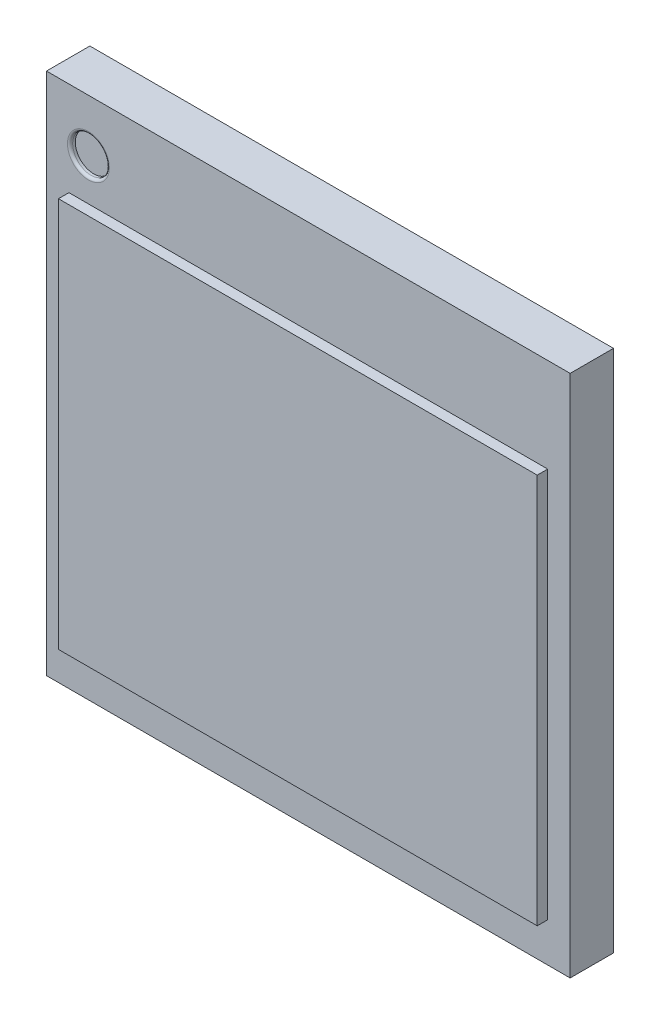
ISO-10303-21;
HEADER;
FILE_DESCRIPTION(('STEP AP214'),'2;1');
FILE_NAME('part.step','',(''),(''),'','','');
FILE_SCHEMA(('AUTOMOTIVE_DESIGN { 1 0 10303 214 1 1 1 1 }'));
ENDSEC;
DATA;
#1=APPLICATION_CONTEXT('core data for automotive mechanical design processes');
#2=APPLICATION_PROTOCOL_DEFINITION('international standard','automotive_design',2000,#1);
#3=PRODUCT_CONTEXT('',#1,'mechanical');
#4=PRODUCT('Part','Part','',(#3));
#5=PRODUCT_RELATED_PRODUCT_CATEGORY('part','',(#4));
#6=PRODUCT_DEFINITION_FORMATION('','',#4);
#7=PRODUCT_DEFINITION_CONTEXT('part definition',#1,'design');
#8=PRODUCT_DEFINITION('design','',#6,#7);
#9=PRODUCT_DEFINITION_SHAPE('','',#8);
#10=(LENGTH_UNIT() NAMED_UNIT(*) SI_UNIT(.MILLI.,.METRE.));
#11=(NAMED_UNIT(*) PLANE_ANGLE_UNIT() SI_UNIT($,.RADIAN.));
#12=(NAMED_UNIT(*) SI_UNIT($,.STERADIAN.) SOLID_ANGLE_UNIT());
#13=UNCERTAINTY_MEASURE_WITH_UNIT(LENGTH_MEASURE(1.E-05),#10,'distance_accuracy_value','');
#14=(GEOMETRIC_REPRESENTATION_CONTEXT(3) GLOBAL_UNCERTAINTY_ASSIGNED_CONTEXT((#13)) GLOBAL_UNIT_ASSIGNED_CONTEXT((#10,
#11,#12)) REPRESENTATION_CONTEXT('',''));
#15=CARTESIAN_POINT('',(0.,0.,0.));
#16=DIRECTION('',(0.,0.,1.));
#17=DIRECTION('',(1.,0.,0.));
#18=AXIS2_PLACEMENT_3D('',#15,#16,#17);
#19=CARTESIAN_POINT('',(0.,0.,0.624));
#20=DIRECTION('',(0.,0.,1.));
#21=DIRECTION('',(1.,0.,0.));
#22=AXIS2_PLACEMENT_3D('',#19,#20,#21);
#23=PLANE('',#22);
#24=CARTESIAN_POINT('',(-2.1,2.,0.624));
#25=DIRECTION('',(0.,0.,1.));
#26=DIRECTION('',(1.,0.,0.));
#27=AXIS2_PLACEMENT_3D('',#24,#25,#26);
#28=CIRCLE('',#27,0.2);
#29=CARTESIAN_POINT('',(-1.9,2.,0.624));
#30=VERTEX_POINT('',#29);
#31=EDGE_CURVE('E11',#30,#30,#28,.F.);
#32=ORIENTED_EDGE('',*,*,#31,.T.);
#33=EDGE_LOOP('',(#32));
#34=FACE_BOUND('',#33,.T.);
#35=DIRECTION('',(0.,-1.,0.));
#36=VECTOR('',#35,1.);
#37=CARTESIAN_POINT('',(-2.5,2.5,0.624));
#38=LINE('',#37,#36);
#39=CARTESIAN_POINT('',(-2.5,2.5,0.624));
#40=VERTEX_POINT('',#39);
#41=CARTESIAN_POINT('',(-2.5,-2.5,0.624));
#42=VERTEX_POINT('',#41);
#43=EDGE_CURVE('E146',#40,#42,#38,.T.);
#44=ORIENTED_EDGE('',*,*,#43,.T.);
#45=DIRECTION('',(1.,0.,0.));
#46=VECTOR('',#45,1.);
#47=CARTESIAN_POINT('',(-2.5,-2.5,0.624));
#48=LINE('',#47,#46);
#49=CARTESIAN_POINT('',(2.5,-2.5,0.624));
#50=VERTEX_POINT('',#49);
#51=EDGE_CURVE('E91',#42,#50,#48,.T.);
#52=ORIENTED_EDGE('',*,*,#51,.T.);
#53=DIRECTION('',(0.,1.,0.));
#54=VECTOR('',#53,1.);
#55=CARTESIAN_POINT('',(2.5,2.5,0.624));
#56=LINE('',#55,#54);
#57=CARTESIAN_POINT('',(2.5,2.5,0.624));
#58=VERTEX_POINT('',#57);
#59=EDGE_CURVE('E149',#50,#58,#56,.T.);
#60=ORIENTED_EDGE('',*,*,#59,.T.);
#61=DIRECTION('',(-1.,0.,0.));
#62=VECTOR('',#61,1.);
#63=CARTESIAN_POINT('',(-2.5,2.5,0.624));
#64=LINE('',#63,#62);
#65=EDGE_CURVE('E62',#58,#40,#64,.T.);
#66=ORIENTED_EDGE('',*,*,#65,.T.);
#67=EDGE_LOOP('',(#44,#52,#60,#66));
#68=FACE_BOUND('',#67,.T.);
#69=DIRECTION('',(-1.,0.,0.));
#70=VECTOR('',#69,1.);
#71=CARTESIAN_POINT('',(-2.28579882244162,1.60135243721626,0.624));
#72=LINE('',#71,#70);
#73=CARTESIAN_POINT('',(2.28579882244162,1.60135243721626,0.624));
#74=VERTEX_POINT('',#73);
#75=CARTESIAN_POINT('',(-2.28579882244162,1.60135243721626,0.624));
#76=VERTEX_POINT('',#75);
#77=EDGE_CURVE('E304',#74,#76,#72,.T.);
#78=ORIENTED_EDGE('',*,*,#77,.F.);
#79=DIRECTION('',(0.,1.,0.));
#80=VECTOR('',#79,1.);
#81=CARTESIAN_POINT('',(2.28579882244162,1.60135243721626,0.624));
#82=LINE('',#81,#80);
#83=CARTESIAN_POINT('',(2.28579882244162,-2.125692027521,0.624));
#84=VERTEX_POINT('',#83);
#85=EDGE_CURVE('E136',#84,#74,#82,.T.);
#86=ORIENTED_EDGE('',*,*,#85,.F.);
#87=DIRECTION('',(1.,0.,0.));
#88=VECTOR('',#87,1.);
#89=CARTESIAN_POINT('',(-2.28579882244162,-2.125692027521,0.624));
#90=LINE('',#89,#88);
#91=CARTESIAN_POINT('',(-2.28579882244162,-2.125692027521,0.624));
#92=VERTEX_POINT('',#91);
#93=EDGE_CURVE('E132',#92,#84,#90,.T.);
#94=ORIENTED_EDGE('',*,*,#93,.F.);
#95=DIRECTION('',(0.,-1.,0.));
#96=VECTOR('',#95,1.);
#97=CARTESIAN_POINT('',(-2.28579882244162,1.60135243721626,0.624));
#98=LINE('',#97,#96);
#99=EDGE_CURVE('E306',#76,#92,#98,.T.);
#100=ORIENTED_EDGE('',*,*,#99,.F.);
#101=EDGE_LOOP('',(#78,#86,#94,#100));
#102=FACE_BOUND('',#101,.T.);
#103=ADVANCED_FACE('F38',(#34,#68,#102),#23,.T.);
#104=CARTESIAN_POINT('',(0.,0.,0.21));
#105=DIRECTION('',(0.,0.,1.));
#106=DIRECTION('',(1.,0.,0.));
#107=AXIS2_PLACEMENT_3D('',#104,#105,#106);
#108=PLANE('',#107);
#109=DIRECTION('',(0.,-1.,0.));
#110=VECTOR('',#109,1.);
#111=CARTESIAN_POINT('',(-2.5,2.5,0.21));
#112=LINE('',#111,#110);
#113=CARTESIAN_POINT('',(-2.5,2.5,0.21));
#114=VERTEX_POINT('',#113);
#115=CARTESIAN_POINT('',(-2.5,-2.5,0.21));
#116=VERTEX_POINT('',#115);
#117=EDGE_CURVE('E141',#114,#116,#112,.T.);
#118=ORIENTED_EDGE('',*,*,#117,.F.);
#119=DIRECTION('',(-1.,0.,0.));
#120=VECTOR('',#119,1.);
#121=CARTESIAN_POINT('',(-2.5,2.5,0.21));
#122=LINE('',#121,#120);
#123=CARTESIAN_POINT('',(2.5,2.5,0.21));
#124=VERTEX_POINT('',#123);
#125=EDGE_CURVE('E83',#124,#114,#122,.T.);
#126=ORIENTED_EDGE('',*,*,#125,.F.);
#127=DIRECTION('',(0.,1.,0.));
#128=VECTOR('',#127,1.);
#129=CARTESIAN_POINT('',(2.5,2.5,0.21));
#130=LINE('',#129,#128);
#131=CARTESIAN_POINT('',(2.5,-2.5,0.21));
#132=VERTEX_POINT('',#131);
#133=EDGE_CURVE('E157',#132,#124,#130,.T.);
#134=ORIENTED_EDGE('',*,*,#133,.F.);
#135=DIRECTION('',(1.,0.,0.));
#136=VECTOR('',#135,1.);
#137=CARTESIAN_POINT('',(-2.5,-2.5,0.21));
#138=LINE('',#137,#136);
#139=EDGE_CURVE('E155',#116,#132,#138,.T.);
#140=ORIENTED_EDGE('',*,*,#139,.F.);
#141=EDGE_LOOP('',(#118,#126,#134,#140));
#142=FACE_BOUND('',#141,.T.);
#143=CARTESIAN_POINT('',(-1.96,1.9,0.21));
#144=DIRECTION('',(0.,0.,1.));
#145=DIRECTION('',(1.,0.,0.));
#146=AXIS2_PLACEMENT_3D('',#143,#144,#145);
#147=CIRCLE('',#146,0.148492424049175);
#148=CARTESIAN_POINT('',(-1.81150757595082,1.9,0.21));
#149=VERTEX_POINT('',#148);
#150=EDGE_CURVE('E168',#149,#149,#147,.F.);
#151=ORIENTED_EDGE('',*,*,#150,.F.);
#152=EDGE_LOOP('',(#151));
#153=FACE_BOUND('',#152,.T.);
#154=CARTESIAN_POINT('',(-1.16,1.9,0.21));
#155=DIRECTION('',(0.,0.,1.));
#156=DIRECTION('',(1.,0.,0.));
#157=AXIS2_PLACEMENT_3D('',#154,#155,#156);
#158=CIRCLE('',#157,0.148492424049175);
#159=CARTESIAN_POINT('',(-1.01150757595082,1.9,0.21));
#160=VERTEX_POINT('',#159);
#161=EDGE_CURVE('E171',#160,#160,#158,.F.);
#162=ORIENTED_EDGE('',*,*,#161,.F.);
#163=EDGE_LOOP('',(#162));
#164=FACE_BOUND('',#163,.T.);
#165=CARTESIAN_POINT('',(-0.36,1.9,0.21));
#166=DIRECTION('',(0.,0.,1.));
#167=DIRECTION('',(1.,0.,0.));
#168=AXIS2_PLACEMENT_3D('',#165,#166,#167);
#169=CIRCLE('',#168,0.148492424049175);
#170=CARTESIAN_POINT('',(-0.211507575950825,1.9,0.21));
#171=VERTEX_POINT('',#170);
#172=EDGE_CURVE('E174',#171,#171,#169,.F.);
#173=ORIENTED_EDGE('',*,*,#172,.F.);
#174=EDGE_LOOP('',(#173));
#175=FACE_BOUND('',#174,.T.);
#176=CARTESIAN_POINT('',(0.44,1.9,0.21));
#177=DIRECTION('',(0.,0.,1.));
#178=DIRECTION('',(1.,0.,0.));
#179=AXIS2_PLACEMENT_3D('',#176,#177,#178);
#180=CIRCLE('',#179,0.148492424049175);
#181=CARTESIAN_POINT('',(0.588492424049175,1.9,0.21));
#182=VERTEX_POINT('',#181);
#183=EDGE_CURVE('E177',#182,#182,#180,.F.);
#184=ORIENTED_EDGE('',*,*,#183,.F.);
#185=EDGE_LOOP('',(#184));
#186=FACE_BOUND('',#185,.T.);
#187=CARTESIAN_POINT('',(1.24,1.9,0.21));
#188=DIRECTION('',(0.,0.,1.));
#189=DIRECTION('',(1.,0.,0.));
#190=AXIS2_PLACEMENT_3D('',#187,#188,#189);
#191=CIRCLE('',#190,0.148492424049175);
#192=CARTESIAN_POINT('',(1.38849242404918,1.9,0.21));
#193=VERTEX_POINT('',#192);
#194=EDGE_CURVE('E180',#193,#193,#191,.F.);
#195=ORIENTED_EDGE('',*,*,#194,.F.);
#196=EDGE_LOOP('',(#195));
#197=FACE_BOUND('',#196,.T.);
#198=CARTESIAN_POINT('',(2.04,1.9,0.21));
#199=DIRECTION('',(0.,0.,1.));
#200=DIRECTION('',(1.,0.,0.));
#201=AXIS2_PLACEMENT_3D('',#198,#199,#200);
#202=CIRCLE('',#201,0.148492424049175);
#203=CARTESIAN_POINT('',(2.18849242404918,1.9,0.21));
#204=VERTEX_POINT('',#203);
#205=EDGE_CURVE('E183',#204,#204,#202,.F.);
#206=ORIENTED_EDGE('',*,*,#205,.F.);
#207=EDGE_LOOP('',(#206));
#208=FACE_BOUND('',#207,.T.);
#209=CARTESIAN_POINT('',(-1.96,1.15,0.21));
#210=DIRECTION('',(0.,0.,1.));
#211=DIRECTION('',(1.,0.,0.));
#212=AXIS2_PLACEMENT_3D('',#209,#210,#211);
#213=CIRCLE('',#212,0.148492424049175);
#214=CARTESIAN_POINT('',(-1.81150757595082,1.15,0.21));
#215=VERTEX_POINT('',#214);
#216=EDGE_CURVE('E186',#215,#215,#213,.F.);
#217=ORIENTED_EDGE('',*,*,#216,.F.);
#218=EDGE_LOOP('',(#217));
#219=FACE_BOUND('',#218,.T.);
#220=CARTESIAN_POINT('',(-1.16,1.15,0.21));
#221=DIRECTION('',(0.,0.,1.));
#222=DIRECTION('',(1.,0.,0.));
#223=AXIS2_PLACEMENT_3D('',#220,#221,#222);
#224=CIRCLE('',#223,0.148492424049175);
#225=CARTESIAN_POINT('',(-1.01150757595082,1.15,0.21));
#226=VERTEX_POINT('',#225);
#227=EDGE_CURVE('E189',#226,#226,#224,.F.);
#228=ORIENTED_EDGE('',*,*,#227,.F.);
#229=EDGE_LOOP('',(#228));
#230=FACE_BOUND('',#229,.T.);
#231=CARTESIAN_POINT('',(-0.36,1.15,0.21));
#232=DIRECTION('',(0.,0.,1.));
#233=DIRECTION('',(1.,0.,0.));
#234=AXIS2_PLACEMENT_3D('',#231,#232,#233);
#235=CIRCLE('',#234,0.148492424049175);
#236=CARTESIAN_POINT('',(-0.211507575950825,1.15,0.21));
#237=VERTEX_POINT('',#236);
#238=EDGE_CURVE('E192',#237,#237,#235,.F.);
#239=ORIENTED_EDGE('',*,*,#238,.F.);
#240=EDGE_LOOP('',(#239));
#241=FACE_BOUND('',#240,.T.);
#242=CARTESIAN_POINT('',(0.44,1.15,0.21));
#243=DIRECTION('',(0.,0.,1.));
#244=DIRECTION('',(1.,0.,0.));
#245=AXIS2_PLACEMENT_3D('',#242,#243,#244);
#246=CIRCLE('',#245,0.148492424049175);
#247=CARTESIAN_POINT('',(0.588492424049175,1.15,0.21));
#248=VERTEX_POINT('',#247);
#249=EDGE_CURVE('E195',#248,#248,#246,.F.);
#250=ORIENTED_EDGE('',*,*,#249,.F.);
#251=EDGE_LOOP('',(#250));
#252=FACE_BOUND('',#251,.T.);
#253=CARTESIAN_POINT('',(1.24,1.15,0.21));
#254=DIRECTION('',(0.,0.,1.));
#255=DIRECTION('',(1.,0.,0.));
#256=AXIS2_PLACEMENT_3D('',#253,#254,#255);
#257=CIRCLE('',#256,0.148492424049175);
#258=CARTESIAN_POINT('',(1.38849242404918,1.15,0.21));
#259=VERTEX_POINT('',#258);
#260=EDGE_CURVE('E198',#259,#259,#257,.F.);
#261=ORIENTED_EDGE('',*,*,#260,.F.);
#262=EDGE_LOOP('',(#261));
#263=FACE_BOUND('',#262,.T.);
#264=CARTESIAN_POINT('',(2.04,1.15,0.21));
#265=DIRECTION('',(0.,0.,1.));
#266=DIRECTION('',(1.,0.,0.));
#267=AXIS2_PLACEMENT_3D('',#264,#265,#266);
#268=CIRCLE('',#267,0.148492424049175);
#269=CARTESIAN_POINT('',(2.18849242404918,1.15,0.21));
#270=VERTEX_POINT('',#269);
#271=EDGE_CURVE('E201',#270,#270,#268,.F.);
#272=ORIENTED_EDGE('',*,*,#271,.F.);
#273=EDGE_LOOP('',(#272));
#274=FACE_BOUND('',#273,.T.);
#275=CARTESIAN_POINT('',(-1.96,0.4,0.21));
#276=DIRECTION('',(0.,0.,1.));
#277=DIRECTION('',(1.,0.,0.));
#278=AXIS2_PLACEMENT_3D('',#275,#276,#277);
#279=CIRCLE('',#278,0.148492424049175);
#280=CARTESIAN_POINT('',(-1.81150757595082,0.4,0.21));
#281=VERTEX_POINT('',#280);
#282=EDGE_CURVE('E204',#281,#281,#279,.F.);
#283=ORIENTED_EDGE('',*,*,#282,.F.);
#284=EDGE_LOOP('',(#283));
#285=FACE_BOUND('',#284,.T.);
#286=CARTESIAN_POINT('',(2.04,0.399999999999999,0.21));
#287=DIRECTION('',(0.,0.,1.));
#288=DIRECTION('',(1.,0.,0.));
#289=AXIS2_PLACEMENT_3D('',#286,#287,#288);
#290=CIRCLE('',#289,0.148492424049175);
#291=CARTESIAN_POINT('',(2.18849242404918,0.399999999999999,0.21));
#292=VERTEX_POINT('',#291);
#293=EDGE_CURVE('E207',#292,#292,#290,.F.);
#294=ORIENTED_EDGE('',*,*,#293,.F.);
#295=EDGE_LOOP('',(#294));
#296=FACE_BOUND('',#295,.T.);
#297=CARTESIAN_POINT('',(-1.96,-0.35,0.21));
#298=DIRECTION('',(0.,0.,1.));
#299=DIRECTION('',(1.,0.,0.));
#300=AXIS2_PLACEMENT_3D('',#297,#298,#299);
#301=CIRCLE('',#300,0.148492424049175);
#302=CARTESIAN_POINT('',(-1.81150757595082,-0.35,0.21));
#303=VERTEX_POINT('',#302);
#304=EDGE_CURVE('E210',#303,#303,#301,.F.);
#305=ORIENTED_EDGE('',*,*,#304,.F.);
#306=EDGE_LOOP('',(#305));
#307=FACE_BOUND('',#306,.T.);
#308=CARTESIAN_POINT('',(2.04,-0.350000000000001,0.21));
#309=DIRECTION('',(0.,0.,1.));
#310=DIRECTION('',(1.,0.,0.));
#311=AXIS2_PLACEMENT_3D('',#308,#309,#310);
#312=CIRCLE('',#311,0.148492424049175);
#313=CARTESIAN_POINT('',(2.18849242404918,-0.350000000000001,0.21));
#314=VERTEX_POINT('',#313);
#315=EDGE_CURVE('E213',#314,#314,#312,.F.);
#316=ORIENTED_EDGE('',*,*,#315,.F.);
#317=EDGE_LOOP('',(#316));
#318=FACE_BOUND('',#317,.T.);
#319=CARTESIAN_POINT('',(-1.96,-1.1,0.21));
#320=DIRECTION('',(0.,0.,1.));
#321=DIRECTION('',(1.,0.,0.));
#322=AXIS2_PLACEMENT_3D('',#319,#320,#321);
#323=CIRCLE('',#322,0.148492424049175);
#324=CARTESIAN_POINT('',(-1.81150757595082,-1.1,0.21));
#325=VERTEX_POINT('',#324);
#326=EDGE_CURVE('E216',#325,#325,#323,.F.);
#327=ORIENTED_EDGE('',*,*,#326,.F.);
#328=EDGE_LOOP('',(#327));
#329=FACE_BOUND('',#328,.T.);
#330=CARTESIAN_POINT('',(-1.16,-1.1,0.21));
#331=DIRECTION('',(0.,0.,1.));
#332=DIRECTION('',(1.,0.,0.));
#333=AXIS2_PLACEMENT_3D('',#330,#331,#332);
#334=CIRCLE('',#333,0.148492424049175);
#335=CARTESIAN_POINT('',(-1.01150757595082,-1.1,0.21));
#336=VERTEX_POINT('',#335);
#337=EDGE_CURVE('E219',#336,#336,#334,.F.);
#338=ORIENTED_EDGE('',*,*,#337,.F.);
#339=EDGE_LOOP('',(#338));
#340=FACE_BOUND('',#339,.T.);
#341=CARTESIAN_POINT('',(-0.359999999999999,-1.1,0.21));
#342=DIRECTION('',(0.,0.,1.));
#343=DIRECTION('',(1.,0.,0.));
#344=AXIS2_PLACEMENT_3D('',#341,#342,#343);
#345=CIRCLE('',#344,0.148492424049175);
#346=CARTESIAN_POINT('',(-0.211507575950824,-1.1,0.21));
#347=VERTEX_POINT('',#346);
#348=EDGE_CURVE('E222',#347,#347,#345,.F.);
#349=ORIENTED_EDGE('',*,*,#348,.F.);
#350=EDGE_LOOP('',(#349));
#351=FACE_BOUND('',#350,.T.);
#352=CARTESIAN_POINT('',(0.440000000000001,-1.1,0.21));
#353=DIRECTION('',(0.,0.,1.));
#354=DIRECTION('',(1.,0.,0.));
#355=AXIS2_PLACEMENT_3D('',#352,#353,#354);
#356=CIRCLE('',#355,0.148492424049175);
#357=CARTESIAN_POINT('',(0.588492424049176,-1.1,0.21));
#358=VERTEX_POINT('',#357);
#359=EDGE_CURVE('E225',#358,#358,#356,.F.);
#360=ORIENTED_EDGE('',*,*,#359,.F.);
#361=EDGE_LOOP('',(#360));
#362=FACE_BOUND('',#361,.T.);
#363=CARTESIAN_POINT('',(1.24,-1.1,0.21));
#364=DIRECTION('',(0.,0.,1.));
#365=DIRECTION('',(1.,0.,0.));
#366=AXIS2_PLACEMENT_3D('',#363,#364,#365);
#367=CIRCLE('',#366,0.148492424049175);
#368=CARTESIAN_POINT('',(1.38849242404918,-1.1,0.21));
#369=VERTEX_POINT('',#368);
#370=EDGE_CURVE('E228',#369,#369,#367,.F.);
#371=ORIENTED_EDGE('',*,*,#370,.F.);
#372=EDGE_LOOP('',(#371));
#373=FACE_BOUND('',#372,.T.);
#374=CARTESIAN_POINT('',(2.04,-1.1,0.21));
#375=DIRECTION('',(0.,0.,1.));
#376=DIRECTION('',(1.,0.,0.));
#377=AXIS2_PLACEMENT_3D('',#374,#375,#376);
#378=CIRCLE('',#377,0.148492424049175);
#379=CARTESIAN_POINT('',(2.18849242404918,-1.1,0.21));
#380=VERTEX_POINT('',#379);
#381=EDGE_CURVE('E231',#380,#380,#378,.F.);
#382=ORIENTED_EDGE('',*,*,#381,.F.);
#383=EDGE_LOOP('',(#382));
#384=FACE_BOUND('',#383,.T.);
#385=CARTESIAN_POINT('',(-1.96,-1.85,0.21));
#386=DIRECTION('',(0.,0.,1.));
#387=DIRECTION('',(1.,0.,0.));
#388=AXIS2_PLACEMENT_3D('',#385,#386,#387);
#389=CIRCLE('',#388,0.148492424049175);
#390=CARTESIAN_POINT('',(-1.81150757595082,-1.85,0.21));
#391=VERTEX_POINT('',#390);
#392=EDGE_CURVE('E234',#391,#391,#389,.F.);
#393=ORIENTED_EDGE('',*,*,#392,.F.);
#394=EDGE_LOOP('',(#393));
#395=FACE_BOUND('',#394,.T.);
#396=CARTESIAN_POINT('',(-1.16,-1.85,0.21));
#397=DIRECTION('',(0.,0.,1.));
#398=DIRECTION('',(1.,0.,0.));
#399=AXIS2_PLACEMENT_3D('',#396,#397,#398);
#400=CIRCLE('',#399,0.148492424049175);
#401=CARTESIAN_POINT('',(-1.01150757595082,-1.85,0.21));
#402=VERTEX_POINT('',#401);
#403=EDGE_CURVE('E237',#402,#402,#400,.F.);
#404=ORIENTED_EDGE('',*,*,#403,.F.);
#405=EDGE_LOOP('',(#404));
#406=FACE_BOUND('',#405,.T.);
#407=CARTESIAN_POINT('',(-0.359999999999999,-1.85,0.21));
#408=DIRECTION('',(0.,0.,1.));
#409=DIRECTION('',(1.,0.,0.));
#410=AXIS2_PLACEMENT_3D('',#407,#408,#409);
#411=CIRCLE('',#410,0.148492424049175);
#412=CARTESIAN_POINT('',(-0.211507575950824,-1.85,0.21));
#413=VERTEX_POINT('',#412);
#414=EDGE_CURVE('E240',#413,#413,#411,.F.);
#415=ORIENTED_EDGE('',*,*,#414,.F.);
#416=EDGE_LOOP('',(#415));
#417=FACE_BOUND('',#416,.T.);
#418=CARTESIAN_POINT('',(0.440000000000001,-1.85,0.21));
#419=DIRECTION('',(0.,0.,1.));
#420=DIRECTION('',(1.,0.,0.));
#421=AXIS2_PLACEMENT_3D('',#418,#419,#420);
#422=CIRCLE('',#421,0.148492424049175);
#423=CARTESIAN_POINT('',(0.588492424049176,-1.85,0.21));
#424=VERTEX_POINT('',#423);
#425=EDGE_CURVE('E243',#424,#424,#422,.F.);
#426=ORIENTED_EDGE('',*,*,#425,.F.);
#427=EDGE_LOOP('',(#426));
#428=FACE_BOUND('',#427,.T.);
#429=CARTESIAN_POINT('',(1.24,-1.85,0.21));
#430=DIRECTION('',(0.,0.,1.));
#431=DIRECTION('',(1.,0.,0.));
#432=AXIS2_PLACEMENT_3D('',#429,#430,#431);
#433=CIRCLE('',#432,0.148492424049175);
#434=CARTESIAN_POINT('',(1.38849242404918,-1.85,0.21));
#435=VERTEX_POINT('',#434);
#436=EDGE_CURVE('E246',#435,#435,#433,.F.);
#437=ORIENTED_EDGE('',*,*,#436,.F.);
#438=EDGE_LOOP('',(#437));
#439=FACE_BOUND('',#438,.T.);
#440=CARTESIAN_POINT('',(2.04,-1.85,0.21));
#441=DIRECTION('',(0.,0.,1.));
#442=DIRECTION('',(1.,0.,0.));
#443=AXIS2_PLACEMENT_3D('',#440,#441,#442);
#444=CIRCLE('',#443,0.148492424049175);
#445=CARTESIAN_POINT('',(2.18849242404918,-1.85,0.21));
#446=VERTEX_POINT('',#445);
#447=EDGE_CURVE('E249',#446,#446,#444,.F.);
#448=ORIENTED_EDGE('',*,*,#447,.F.);
#449=EDGE_LOOP('',(#448));
#450=FACE_BOUND('',#449,.T.);
#451=ADVANCED_FACE('F269',(#142,#153,#164,#175,#186,#197,#208,#219,#230,#241,#252,#263,#274,
#285,#296,#307,#318,#329,#340,#351,#362,#373,#384,#395,#406,#417,#428,#439,#450),#108,.F.);
#452=CARTESIAN_POINT('',(-2.5,2.5,0.624));
#453=DIRECTION('',(1.,0.,0.));
#454=DIRECTION('',(0.,1.,0.));
#455=AXIS2_PLACEMENT_3D('',#452,#453,#454);
#456=PLANE('',#455);
#457=ORIENTED_EDGE('',*,*,#117,.T.);
#458=DIRECTION('',(0.,0.,-1.));
#459=VECTOR('',#458,1.);
#460=CARTESIAN_POINT('',(-2.5,-2.5,0.624));
#461=LINE('',#460,#459);
#462=EDGE_CURVE('E166',#42,#116,#461,.T.);
#463=ORIENTED_EDGE('',*,*,#462,.F.);
#464=ORIENTED_EDGE('',*,*,#43,.F.);
#465=DIRECTION('',(0.,0.,-1.));
#466=VECTOR('',#465,1.);
#467=CARTESIAN_POINT('',(-2.5,2.5,0.624));
#468=LINE('',#467,#466);
#469=EDGE_CURVE('E152',#40,#114,#468,.T.);
#470=ORIENTED_EDGE('',*,*,#469,.T.);
#471=EDGE_LOOP('',(#457,#463,#464,#470));
#472=FACE_BOUND('',#471,.T.);
#473=ADVANCED_FACE('F275',(#472),#456,.F.);
#474=CARTESIAN_POINT('',(-2.5,-2.5,0.624));
#475=DIRECTION('',(0.,1.,0.));
#476=DIRECTION('',(0.,0.,1.));
#477=AXIS2_PLACEMENT_3D('',#474,#475,#476);
#478=PLANE('',#477);
#479=ORIENTED_EDGE('',*,*,#139,.T.);
#480=DIRECTION('',(0.,0.,-1.));
#481=VECTOR('',#480,1.);
#482=CARTESIAN_POINT('',(2.5,-2.5,0.624));
#483=LINE('',#482,#481);
#484=EDGE_CURVE('E163',#50,#132,#483,.T.);
#485=ORIENTED_EDGE('',*,*,#484,.F.);
#486=ORIENTED_EDGE('',*,*,#51,.F.);
#487=ORIENTED_EDGE('',*,*,#462,.T.);
#488=EDGE_LOOP('',(#479,#485,#486,#487));
#489=FACE_BOUND('',#488,.T.);
#490=ADVANCED_FACE('F288',(#489),#478,.F.);
#491=CARTESIAN_POINT('',(2.5,2.5,0.624));
#492=DIRECTION('',(-1.,0.,0.));
#493=DIRECTION('',(0.,0.,1.));
#494=AXIS2_PLACEMENT_3D('',#491,#492,#493);
#495=PLANE('',#494);
#496=ORIENTED_EDGE('',*,*,#133,.T.);
#497=DIRECTION('',(0.,0.,-1.));
#498=VECTOR('',#497,1.);
#499=CARTESIAN_POINT('',(2.5,2.5,0.624));
#500=LINE('',#499,#498);
#501=EDGE_CURVE('E161',#58,#124,#500,.T.);
#502=ORIENTED_EDGE('',*,*,#501,.F.);
#503=ORIENTED_EDGE('',*,*,#59,.F.);
#504=ORIENTED_EDGE('',*,*,#484,.T.);
#505=EDGE_LOOP('',(#496,#502,#503,#504));
#506=FACE_BOUND('',#505,.T.);
#507=ADVANCED_FACE('F285',(#506),#495,.F.);
#508=CARTESIAN_POINT('',(-2.5,2.5,0.624));
#509=DIRECTION('',(0.,-1.,0.));
#510=DIRECTION('',(1.,0.,0.));
#511=AXIS2_PLACEMENT_3D('',#508,#509,#510);
#512=PLANE('',#511);
#513=ORIENTED_EDGE('',*,*,#125,.T.);
#514=ORIENTED_EDGE('',*,*,#469,.F.);
#515=ORIENTED_EDGE('',*,*,#65,.F.);
#516=ORIENTED_EDGE('',*,*,#501,.T.);
#517=EDGE_LOOP('',(#513,#514,#515,#516));
#518=FACE_BOUND('',#517,.T.);
#519=ADVANCED_FACE('F282',(#518),#512,.F.);
#520=CARTESIAN_POINT('',(-1.96,1.9,0.1575));
#521=DIRECTION('',(0.,0.,1.));
#522=DIRECTION('',(-1.,0.,0.));
#523=AXIS2_PLACEMENT_3D('',#520,#521,#522);
#524=SPHERICAL_SURFACE('',#523,0.1575);
#525=ORIENTED_EDGE('',*,*,#150,.T.);
#526=EDGE_LOOP('',(#525));
#527=FACE_BOUND('',#526,.T.);
#528=ADVANCED_FACE('F279',(#527),#524,.T.);
#529=CARTESIAN_POINT('',(-1.16,1.9,0.1575));
#530=DIRECTION('',(0.,0.,1.));
#531=DIRECTION('',(-1.,0.,0.));
#532=AXIS2_PLACEMENT_3D('',#529,#530,#531);
#533=SPHERICAL_SURFACE('',#532,0.1575);
#534=ORIENTED_EDGE('',*,*,#161,.T.);
#535=EDGE_LOOP('',(#534));
#536=FACE_BOUND('',#535,.T.);
#537=ADVANCED_FACE('F433',(#536),#533,.T.);
#538=CARTESIAN_POINT('',(-0.36,1.9,0.1575));
#539=DIRECTION('',(0.,0.,1.));
#540=DIRECTION('',(-1.,0.,0.));
#541=AXIS2_PLACEMENT_3D('',#538,#539,#540);
#542=SPHERICAL_SURFACE('',#541,0.1575);
#543=ORIENTED_EDGE('',*,*,#172,.T.);
#544=EDGE_LOOP('',(#543));
#545=FACE_BOUND('',#544,.T.);
#546=ADVANCED_FACE('F430',(#545),#542,.T.);
#547=CARTESIAN_POINT('',(0.44,1.9,0.1575));
#548=DIRECTION('',(0.,0.,1.));
#549=DIRECTION('',(-1.,0.,0.));
#550=AXIS2_PLACEMENT_3D('',#547,#548,#549);
#551=SPHERICAL_SURFACE('',#550,0.1575);
#552=ORIENTED_EDGE('',*,*,#183,.T.);
#553=EDGE_LOOP('',(#552));
#554=FACE_BOUND('',#553,.T.);
#555=ADVANCED_FACE('F426',(#554),#551,.T.);
#556=CARTESIAN_POINT('',(1.24,1.9,0.1575));
#557=DIRECTION('',(0.,0.,1.));
#558=DIRECTION('',(-1.,0.,0.));
#559=AXIS2_PLACEMENT_3D('',#556,#557,#558);
#560=SPHERICAL_SURFACE('',#559,0.1575);
#561=ORIENTED_EDGE('',*,*,#194,.T.);
#562=EDGE_LOOP('',(#561));
#563=FACE_BOUND('',#562,.T.);
#564=ADVANCED_FACE('F422',(#563),#560,.T.);
#565=CARTESIAN_POINT('',(2.04,1.9,0.1575));
#566=DIRECTION('',(0.,0.,1.));
#567=DIRECTION('',(-1.,0.,0.));
#568=AXIS2_PLACEMENT_3D('',#565,#566,#567);
#569=SPHERICAL_SURFACE('',#568,0.1575);
#570=ORIENTED_EDGE('',*,*,#205,.T.);
#571=EDGE_LOOP('',(#570));
#572=FACE_BOUND('',#571,.T.);
#573=ADVANCED_FACE('F418',(#572),#569,.T.);
#574=CARTESIAN_POINT('',(-1.96,1.15,0.1575));
#575=DIRECTION('',(0.,0.,1.));
#576=DIRECTION('',(-1.,0.,0.));
#577=AXIS2_PLACEMENT_3D('',#574,#575,#576);
#578=SPHERICAL_SURFACE('',#577,0.1575);
#579=ORIENTED_EDGE('',*,*,#216,.T.);
#580=EDGE_LOOP('',(#579));
#581=FACE_BOUND('',#580,.T.);
#582=ADVANCED_FACE('F414',(#581),#578,.T.);
#583=CARTESIAN_POINT('',(-1.16,1.15,0.1575));
#584=DIRECTION('',(0.,0.,1.));
#585=DIRECTION('',(-1.,0.,0.));
#586=AXIS2_PLACEMENT_3D('',#583,#584,#585);
#587=SPHERICAL_SURFACE('',#586,0.1575);
#588=ORIENTED_EDGE('',*,*,#227,.T.);
#589=EDGE_LOOP('',(#588));
#590=FACE_BOUND('',#589,.T.);
#591=ADVANCED_FACE('F410',(#590),#587,.T.);
#592=CARTESIAN_POINT('',(-0.36,1.15,0.1575));
#593=DIRECTION('',(0.,0.,1.));
#594=DIRECTION('',(-1.,0.,0.));
#595=AXIS2_PLACEMENT_3D('',#592,#593,#594);
#596=SPHERICAL_SURFACE('',#595,0.1575);
#597=ORIENTED_EDGE('',*,*,#238,.T.);
#598=EDGE_LOOP('',(#597));
#599=FACE_BOUND('',#598,.T.);
#600=ADVANCED_FACE('F406',(#599),#596,.T.);
#601=CARTESIAN_POINT('',(0.44,1.15,0.1575));
#602=DIRECTION('',(0.,0.,1.));
#603=DIRECTION('',(-1.,0.,0.));
#604=AXIS2_PLACEMENT_3D('',#601,#602,#603);
#605=SPHERICAL_SURFACE('',#604,0.1575);
#606=ORIENTED_EDGE('',*,*,#249,.T.);
#607=EDGE_LOOP('',(#606));
#608=FACE_BOUND('',#607,.T.);
#609=ADVANCED_FACE('F402',(#608),#605,.T.);
#610=CARTESIAN_POINT('',(1.24,1.15,0.1575));
#611=DIRECTION('',(0.,0.,1.));
#612=DIRECTION('',(-1.,0.,0.));
#613=AXIS2_PLACEMENT_3D('',#610,#611,#612);
#614=SPHERICAL_SURFACE('',#613,0.1575);
#615=ORIENTED_EDGE('',*,*,#260,.T.);
#616=EDGE_LOOP('',(#615));
#617=FACE_BOUND('',#616,.T.);
#618=ADVANCED_FACE('F398',(#617),#614,.T.);
#619=CARTESIAN_POINT('',(2.04,1.15,0.1575));
#620=DIRECTION('',(0.,0.,1.));
#621=DIRECTION('',(-1.,0.,0.));
#622=AXIS2_PLACEMENT_3D('',#619,#620,#621);
#623=SPHERICAL_SURFACE('',#622,0.1575);
#624=ORIENTED_EDGE('',*,*,#271,.T.);
#625=EDGE_LOOP('',(#624));
#626=FACE_BOUND('',#625,.T.);
#627=ADVANCED_FACE('F394',(#626),#623,.T.);
#628=CARTESIAN_POINT('',(-1.96,0.4,0.1575));
#629=DIRECTION('',(0.,0.,1.));
#630=DIRECTION('',(-1.,0.,0.));
#631=AXIS2_PLACEMENT_3D('',#628,#629,#630);
#632=SPHERICAL_SURFACE('',#631,0.1575);
#633=ORIENTED_EDGE('',*,*,#282,.T.);
#634=EDGE_LOOP('',(#633));
#635=FACE_BOUND('',#634,.T.);
#636=ADVANCED_FACE('F390',(#635),#632,.T.);
#637=CARTESIAN_POINT('',(2.04,0.399999999999999,0.1575));
#638=DIRECTION('',(0.,0.,1.));
#639=DIRECTION('',(-1.,0.,0.));
#640=AXIS2_PLACEMENT_3D('',#637,#638,#639);
#641=SPHERICAL_SURFACE('',#640,0.1575);
#642=ORIENTED_EDGE('',*,*,#293,.T.);
#643=EDGE_LOOP('',(#642));
#644=FACE_BOUND('',#643,.T.);
#645=ADVANCED_FACE('F386',(#644),#641,.T.);
#646=CARTESIAN_POINT('',(-1.96,-0.35,0.1575));
#647=DIRECTION('',(0.,0.,1.));
#648=DIRECTION('',(-1.,0.,0.));
#649=AXIS2_PLACEMENT_3D('',#646,#647,#648);
#650=SPHERICAL_SURFACE('',#649,0.1575);
#651=ORIENTED_EDGE('',*,*,#304,.T.);
#652=EDGE_LOOP('',(#651));
#653=FACE_BOUND('',#652,.T.);
#654=ADVANCED_FACE('F382',(#653),#650,.T.);
#655=CARTESIAN_POINT('',(2.04,-0.350000000000001,0.1575));
#656=DIRECTION('',(0.,0.,1.));
#657=DIRECTION('',(-1.,0.,0.));
#658=AXIS2_PLACEMENT_3D('',#655,#656,#657);
#659=SPHERICAL_SURFACE('',#658,0.1575);
#660=ORIENTED_EDGE('',*,*,#315,.T.);
#661=EDGE_LOOP('',(#660));
#662=FACE_BOUND('',#661,.T.);
#663=ADVANCED_FACE('F378',(#662),#659,.T.);
#664=CARTESIAN_POINT('',(-1.96,-1.1,0.1575));
#665=DIRECTION('',(0.,0.,1.));
#666=DIRECTION('',(-1.,0.,0.));
#667=AXIS2_PLACEMENT_3D('',#664,#665,#666);
#668=SPHERICAL_SURFACE('',#667,0.1575);
#669=ORIENTED_EDGE('',*,*,#326,.T.);
#670=EDGE_LOOP('',(#669));
#671=FACE_BOUND('',#670,.T.);
#672=ADVANCED_FACE('F374',(#671),#668,.T.);
#673=CARTESIAN_POINT('',(-1.16,-1.1,0.1575));
#674=DIRECTION('',(0.,0.,1.));
#675=DIRECTION('',(-1.,0.,0.));
#676=AXIS2_PLACEMENT_3D('',#673,#674,#675);
#677=SPHERICAL_SURFACE('',#676,0.1575);
#678=ORIENTED_EDGE('',*,*,#337,.T.);
#679=EDGE_LOOP('',(#678));
#680=FACE_BOUND('',#679,.T.);
#681=ADVANCED_FACE('F370',(#680),#677,.T.);
#682=CARTESIAN_POINT('',(-0.359999999999999,-1.1,0.1575));
#683=DIRECTION('',(0.,0.,1.));
#684=DIRECTION('',(-1.,0.,0.));
#685=AXIS2_PLACEMENT_3D('',#682,#683,#684);
#686=SPHERICAL_SURFACE('',#685,0.1575);
#687=ORIENTED_EDGE('',*,*,#348,.T.);
#688=EDGE_LOOP('',(#687));
#689=FACE_BOUND('',#688,.T.);
#690=ADVANCED_FACE('F366',(#689),#686,.T.);
#691=CARTESIAN_POINT('',(0.440000000000001,-1.1,0.1575));
#692=DIRECTION('',(0.,0.,1.));
#693=DIRECTION('',(-1.,0.,0.));
#694=AXIS2_PLACEMENT_3D('',#691,#692,#693);
#695=SPHERICAL_SURFACE('',#694,0.1575);
#696=ORIENTED_EDGE('',*,*,#359,.T.);
#697=EDGE_LOOP('',(#696));
#698=FACE_BOUND('',#697,.T.);
#699=ADVANCED_FACE('F362',(#698),#695,.T.);
#700=CARTESIAN_POINT('',(1.24,-1.1,0.1575));
#701=DIRECTION('',(0.,0.,1.));
#702=DIRECTION('',(-1.,0.,0.));
#703=AXIS2_PLACEMENT_3D('',#700,#701,#702);
#704=SPHERICAL_SURFACE('',#703,0.1575);
#705=ORIENTED_EDGE('',*,*,#370,.T.);
#706=EDGE_LOOP('',(#705));
#707=FACE_BOUND('',#706,.T.);
#708=ADVANCED_FACE('F358',(#707),#704,.T.);
#709=CARTESIAN_POINT('',(2.04,-1.1,0.1575));
#710=DIRECTION('',(0.,0.,1.));
#711=DIRECTION('',(-1.,0.,0.));
#712=AXIS2_PLACEMENT_3D('',#709,#710,#711);
#713=SPHERICAL_SURFACE('',#712,0.1575);
#714=ORIENTED_EDGE('',*,*,#381,.T.);
#715=EDGE_LOOP('',(#714));
#716=FACE_BOUND('',#715,.T.);
#717=ADVANCED_FACE('F354',(#716),#713,.T.);
#718=CARTESIAN_POINT('',(-1.96,-1.85,0.1575));
#719=DIRECTION('',(0.,0.,1.));
#720=DIRECTION('',(-1.,0.,0.));
#721=AXIS2_PLACEMENT_3D('',#718,#719,#720);
#722=SPHERICAL_SURFACE('',#721,0.1575);
#723=ORIENTED_EDGE('',*,*,#392,.T.);
#724=EDGE_LOOP('',(#723));
#725=FACE_BOUND('',#724,.T.);
#726=ADVANCED_FACE('F350',(#725),#722,.T.);
#727=CARTESIAN_POINT('',(-1.16,-1.85,0.1575));
#728=DIRECTION('',(0.,0.,1.));
#729=DIRECTION('',(-1.,0.,0.));
#730=AXIS2_PLACEMENT_3D('',#727,#728,#729);
#731=SPHERICAL_SURFACE('',#730,0.1575);
#732=ORIENTED_EDGE('',*,*,#403,.T.);
#733=EDGE_LOOP('',(#732));
#734=FACE_BOUND('',#733,.T.);
#735=ADVANCED_FACE('F346',(#734),#731,.T.);
#736=CARTESIAN_POINT('',(-0.359999999999999,-1.85,0.1575));
#737=DIRECTION('',(0.,0.,1.));
#738=DIRECTION('',(-1.,0.,0.));
#739=AXIS2_PLACEMENT_3D('',#736,#737,#738);
#740=SPHERICAL_SURFACE('',#739,0.1575);
#741=ORIENTED_EDGE('',*,*,#414,.T.);
#742=EDGE_LOOP('',(#741));
#743=FACE_BOUND('',#742,.T.);
#744=ADVANCED_FACE('F342',(#743),#740,.T.);
#745=CARTESIAN_POINT('',(0.440000000000001,-1.85,0.1575));
#746=DIRECTION('',(0.,0.,1.));
#747=DIRECTION('',(-1.,0.,0.));
#748=AXIS2_PLACEMENT_3D('',#745,#746,#747);
#749=SPHERICAL_SURFACE('',#748,0.1575);
#750=ORIENTED_EDGE('',*,*,#425,.T.);
#751=EDGE_LOOP('',(#750));
#752=FACE_BOUND('',#751,.T.);
#753=ADVANCED_FACE('F338',(#752),#749,.T.);
#754=CARTESIAN_POINT('',(1.24,-1.85,0.1575));
#755=DIRECTION('',(0.,0.,1.));
#756=DIRECTION('',(-1.,0.,0.));
#757=AXIS2_PLACEMENT_3D('',#754,#755,#756);
#758=SPHERICAL_SURFACE('',#757,0.1575);
#759=ORIENTED_EDGE('',*,*,#436,.T.);
#760=EDGE_LOOP('',(#759));
#761=FACE_BOUND('',#760,.T.);
#762=ADVANCED_FACE('F334',(#761),#758,.T.);
#763=CARTESIAN_POINT('',(2.04,-1.85,0.1575));
#764=DIRECTION('',(0.,0.,1.));
#765=DIRECTION('',(-1.,0.,0.));
#766=AXIS2_PLACEMENT_3D('',#763,#764,#765);
#767=SPHERICAL_SURFACE('',#766,0.1575);
#768=ORIENTED_EDGE('',*,*,#447,.T.);
#769=EDGE_LOOP('',(#768));
#770=FACE_BOUND('',#769,.T.);
#771=ADVANCED_FACE('F331',(#770),#767,.T.);
#772=CARTESIAN_POINT('',(-2.1,2.,0.574));
#773=DIRECTION('',(0.,0.,1.));
#774=DIRECTION('',(1.,0.,0.));
#775=AXIS2_PLACEMENT_3D('',#772,#773,#774);
#776=CYLINDRICAL_SURFACE('',#775,0.175);
#777=CARTESIAN_POINT('',(-2.1,2.,0.599));
#778=DIRECTION('',(0.,0.,1.));
#779=DIRECTION('',(1.,0.,0.));
#780=AXIS2_PLACEMENT_3D('',#777,#778,#779);
#781=CIRCLE('',#780,0.175);
#782=CARTESIAN_POINT('',(-1.925,2.,0.599));
#783=VERTEX_POINT('',#782);
#784=EDGE_CURVE('E46',#783,#783,#781,.T.);
#785=ORIENTED_EDGE('',*,*,#784,.T.);
#786=EDGE_LOOP('',(#785));
#787=FACE_BOUND('',#786,.T.);
#788=CARTESIAN_POINT('',(-2.1,2.,0.574));
#789=DIRECTION('',(0.,0.,1.));
#790=DIRECTION('',(1.,0.,0.));
#791=AXIS2_PLACEMENT_3D('',#788,#789,#790);
#792=CIRCLE('',#791,0.175);
#793=CARTESIAN_POINT('',(-1.925,2.,0.574));
#794=VERTEX_POINT('',#793);
#795=EDGE_CURVE('E138',#794,#794,#792,.T.);
#796=ORIENTED_EDGE('',*,*,#795,.F.);
#797=EDGE_LOOP('',(#796));
#798=FACE_BOUND('',#797,.T.);
#799=ADVANCED_FACE('F254',(#787,#798),#776,.F.);
#800=CARTESIAN_POINT('',(-2.1,2.,0.574));
#801=DIRECTION('',(0.,0.,1.));
#802=DIRECTION('',(1.,0.,0.));
#803=AXIS2_PLACEMENT_3D('',#800,#801,#802);
#804=PLANE('',#803);
#805=ORIENTED_EDGE('',*,*,#795,.T.);
#806=EDGE_LOOP('',(#805));
#807=FACE_BOUND('',#806,.T.);
#808=ADVANCED_FACE('F258',(#807),#804,.T.);
#809=CARTESIAN_POINT('',(-2.1,2.,0.599));
#810=DIRECTION('',(0.,0.,1.));
#811=DIRECTION('',(1.,0.,0.));
#812=AXIS2_PLACEMENT_3D('',#809,#810,#811);
#813=TOROIDAL_SURFACE('',#812,0.2,0.025);
#814=ORIENTED_EDGE('',*,*,#31,.F.);
#815=EDGE_LOOP('',(#814));
#816=FACE_BOUND('',#815,.T.);
#817=ORIENTED_EDGE('',*,*,#784,.F.);
#818=EDGE_LOOP('',(#817));
#819=FACE_BOUND('',#818,.T.);
#820=ADVANCED_FACE('F40',(#816,#819),#813,.T.);
#821=CARTESIAN_POINT('',(2.28579882244162,1.60135243721626,0.724));
#822=DIRECTION('',(-1.,0.,0.));
#823=DIRECTION('',(0.,0.,1.));
#824=AXIS2_PLACEMENT_3D('',#821,#822,#823);
#825=PLANE('',#824);
#826=ORIENTED_EDGE('',*,*,#85,.T.);
#827=DIRECTION('',(0.,0.,-1.));
#828=VECTOR('',#827,1.);
#829=CARTESIAN_POINT('',(2.28579882244162,1.60135243721626,0.724));
#830=LINE('',#829,#828);
#831=CARTESIAN_POINT('',(2.28579882244162,1.60135243721626,0.724));
#832=VERTEX_POINT('',#831);
#833=EDGE_CURVE('E117',#832,#74,#830,.T.);
#834=ORIENTED_EDGE('',*,*,#833,.F.);
#835=DIRECTION('',(0.,1.,0.));
#836=VECTOR('',#835,1.);
#837=CARTESIAN_POINT('',(2.28579882244162,1.60135243721626,0.724));
#838=LINE('',#837,#836);
#839=CARTESIAN_POINT('',(2.28579882244162,-2.125692027521,0.724));
#840=VERTEX_POINT('',#839);
#841=EDGE_CURVE('E124',#840,#832,#838,.T.);
#842=ORIENTED_EDGE('',*,*,#841,.F.);
#843=DIRECTION('',(0.,0.,-1.));
#844=VECTOR('',#843,1.);
#845=CARTESIAN_POINT('',(2.28579882244162,-2.125692027521,0.724));
#846=LINE('',#845,#844);
#847=EDGE_CURVE('E313',#840,#84,#846,.T.);
#848=ORIENTED_EDGE('',*,*,#847,.T.);
#849=EDGE_LOOP('',(#826,#834,#842,#848));
#850=FACE_BOUND('',#849,.T.);
#851=ADVANCED_FACE('F134',(#850),#825,.F.);
#852=CARTESIAN_POINT('',(-2.28579882244162,1.60135243721626,0.724));
#853=DIRECTION('',(0.,-1.,0.));
#854=DIRECTION('',(0.,0.,-1.));
#855=AXIS2_PLACEMENT_3D('',#852,#853,#854);
#856=PLANE('',#855);
#857=ORIENTED_EDGE('',*,*,#77,.T.);
#858=DIRECTION('',(0.,0.,-1.));
#859=VECTOR('',#858,1.);
#860=CARTESIAN_POINT('',(-2.28579882244162,1.60135243721626,0.724));
#861=LINE('',#860,#859);
#862=CARTESIAN_POINT('',(-2.28579882244162,1.60135243721626,0.724));
#863=VERTEX_POINT('',#862);
#864=EDGE_CURVE('E120',#863,#76,#861,.T.);
#865=ORIENTED_EDGE('',*,*,#864,.F.);
#866=DIRECTION('',(-1.,0.,0.));
#867=VECTOR('',#866,1.);
#868=CARTESIAN_POINT('',(-2.28579882244162,1.60135243721626,0.724));
#869=LINE('',#868,#867);
#870=EDGE_CURVE('E113',#832,#863,#869,.T.);
#871=ORIENTED_EDGE('',*,*,#870,.F.);
#872=ORIENTED_EDGE('',*,*,#833,.T.);
#873=EDGE_LOOP('',(#857,#865,#871,#872));
#874=FACE_BOUND('',#873,.T.);
#875=ADVANCED_FACE('F115',(#874),#856,.F.);
#876=CARTESIAN_POINT('',(-2.28579882244162,1.60135243721626,0.724));
#877=DIRECTION('',(1.,0.,0.));
#878=DIRECTION('',(0.,0.,-1.));
#879=AXIS2_PLACEMENT_3D('',#876,#877,#878);
#880=PLANE('',#879);
#881=ORIENTED_EDGE('',*,*,#99,.T.);
#882=DIRECTION('',(0.,0.,-1.));
#883=VECTOR('',#882,1.);
#884=CARTESIAN_POINT('',(-2.28579882244162,-2.125692027521,0.724));
#885=LINE('',#884,#883);
#886=CARTESIAN_POINT('',(-2.28579882244162,-2.125692027521,0.724));
#887=VERTEX_POINT('',#886);
#888=EDGE_CURVE('E53',#887,#92,#885,.T.);
#889=ORIENTED_EDGE('',*,*,#888,.F.);
#890=DIRECTION('',(0.,-1.,0.));
#891=VECTOR('',#890,1.);
#892=CARTESIAN_POINT('',(-2.28579882244162,1.60135243721626,0.724));
#893=LINE('',#892,#891);
#894=EDGE_CURVE('E123',#863,#887,#893,.T.);
#895=ORIENTED_EDGE('',*,*,#894,.F.);
#896=ORIENTED_EDGE('',*,*,#864,.T.);
#897=EDGE_LOOP('',(#881,#889,#895,#896));
#898=FACE_BOUND('',#897,.T.);
#899=ADVANCED_FACE('F316',(#898),#880,.F.);
#900=CARTESIAN_POINT('',(-2.28579882244162,-2.125692027521,0.724));
#901=DIRECTION('',(0.,1.,0.));
#902=DIRECTION('',(0.,0.,1.));
#903=AXIS2_PLACEMENT_3D('',#900,#901,#902);
#904=PLANE('',#903);
#905=ORIENTED_EDGE('',*,*,#93,.T.);
#906=ORIENTED_EDGE('',*,*,#847,.F.);
#907=DIRECTION('',(1.,0.,0.));
#908=VECTOR('',#907,1.);
#909=CARTESIAN_POINT('',(-2.28579882244162,-2.125692027521,0.724));
#910=LINE('',#909,#908);
#911=EDGE_CURVE('E128',#887,#840,#910,.T.);
#912=ORIENTED_EDGE('',*,*,#911,.F.);
#913=ORIENTED_EDGE('',*,*,#888,.T.);
#914=EDGE_LOOP('',(#905,#906,#912,#913));
#915=FACE_BOUND('',#914,.T.);
#916=ADVANCED_FACE('F317',(#915),#904,.F.);
#917=CARTESIAN_POINT('',(0.,0.,0.724));
#918=DIRECTION('',(0.,0.,1.));
#919=DIRECTION('',(1.,0.,0.));
#920=AXIS2_PLACEMENT_3D('',#917,#918,#919);
#921=PLANE('',#920);
#922=ORIENTED_EDGE('',*,*,#841,.T.);
#923=ORIENTED_EDGE('',*,*,#870,.T.);
#924=ORIENTED_EDGE('',*,*,#894,.T.);
#925=ORIENTED_EDGE('',*,*,#911,.T.);
#926=EDGE_LOOP('',(#922,#923,#924,#925));
#927=FACE_BOUND('',#926,.T.);
#928=ADVANCED_FACE('F127',(#927),#921,.T.);
#929=CLOSED_SHELL('',(#103,#451,#473,#490,#507,#519,#528,#537,#546,#555,#564,#573,#582,#591,
#600,#609,#618,#627,#636,#645,#654,#663,#672,#681,#690,#699,#708,#717,#726,#735,#744,#753,#762,
#771,#799,#808,#820,#851,#875,#899,#916,#928));
#930=MANIFOLD_SOLID_BREP('B2',#929);
#931=ADVANCED_BREP_SHAPE_REPRESENTATION('',(#18,#930),#14);
#932=SHAPE_DEFINITION_REPRESENTATION(#9,#931);
ENDSEC;
END-ISO-10303-21;
